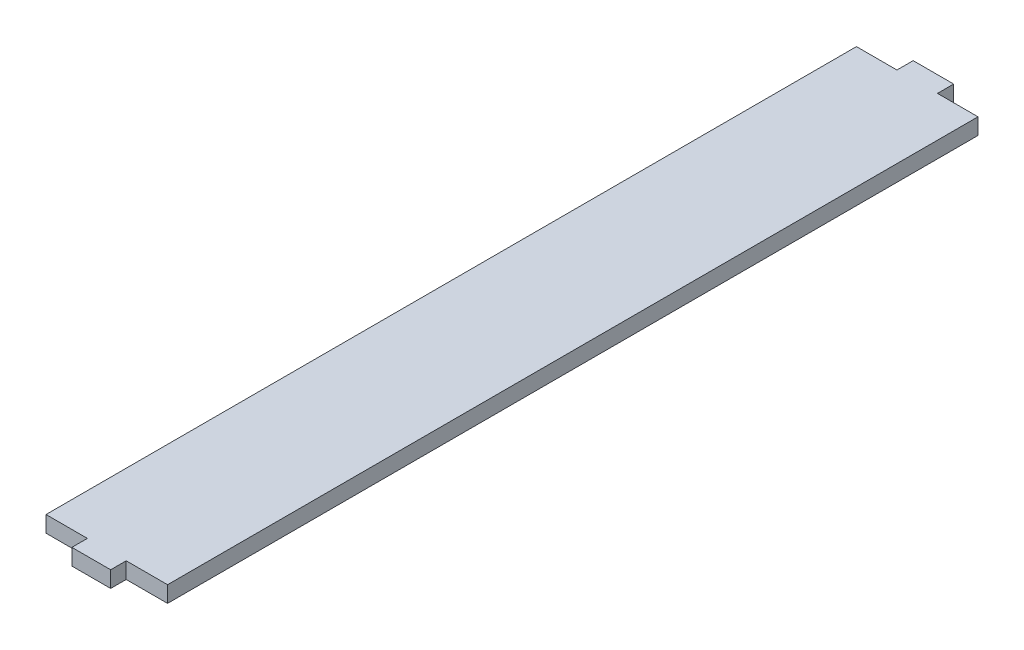
ISO-10303-21;
HEADER;
FILE_DESCRIPTION(('STEP AP214'),'2;1');
FILE_NAME('part.step','',(''),(''),'','','');
FILE_SCHEMA(('AUTOMOTIVE_DESIGN { 1 0 10303 214 1 1 1 1 }'));
ENDSEC;
DATA;
#1=APPLICATION_CONTEXT('core data for automotive mechanical design processes');
#2=APPLICATION_PROTOCOL_DEFINITION('international standard','automotive_design',2000,#1);
#3=PRODUCT_CONTEXT('',#1,'mechanical');
#4=PRODUCT('Part','Part','',(#3));
#5=PRODUCT_RELATED_PRODUCT_CATEGORY('part','',(#4));
#6=PRODUCT_DEFINITION_FORMATION('','',#4);
#7=PRODUCT_DEFINITION_CONTEXT('part definition',#1,'design');
#8=PRODUCT_DEFINITION('design','',#6,#7);
#9=PRODUCT_DEFINITION_SHAPE('','',#8);
#10=(LENGTH_UNIT() NAMED_UNIT(*) SI_UNIT(.MILLI.,.METRE.));
#11=(NAMED_UNIT(*) PLANE_ANGLE_UNIT() SI_UNIT($,.RADIAN.));
#12=(NAMED_UNIT(*) SI_UNIT($,.STERADIAN.) SOLID_ANGLE_UNIT());
#13=UNCERTAINTY_MEASURE_WITH_UNIT(LENGTH_MEASURE(1.E-05),#10,'distance_accuracy_value','');
#14=(GEOMETRIC_REPRESENTATION_CONTEXT(3) GLOBAL_UNCERTAINTY_ASSIGNED_CONTEXT((#13)) GLOBAL_UNIT_ASSIGNED_CONTEXT((#10,
#11,#12)) REPRESENTATION_CONTEXT('',''));
#15=CARTESIAN_POINT('',(0.,0.,0.));
#16=DIRECTION('',(0.,0.,1.));
#17=DIRECTION('',(1.,0.,0.));
#18=AXIS2_PLACEMENT_3D('',#15,#16,#17);
#19=CARTESIAN_POINT('',(-83.6227476409464,4.,31.5625003395719));
#20=DIRECTION('',(0.,0.,-1.));
#21=DIRECTION('',(-1.,0.,0.));
#22=AXIS2_PLACEMENT_3D('',#19,#20,#21);
#23=PLANE('',#22);
#24=DIRECTION('',(1.,0.,0.));
#25=VECTOR('',#24,1.);
#26=CARTESIAN_POINT('',(-83.6227476409464,0.,31.5625003395719));
#27=LINE('',#26,#25);
#28=CARTESIAN_POINT('',(84.6360776419923,0.,31.5625003395718));
#29=VERTEX_POINT('',#28);
#30=CARTESIAN_POINT('',(94.8481880682739,0.,31.5625003395718));
#31=VERTEX_POINT('',#30);
#32=EDGE_CURVE('E238',#29,#31,#27,.T.);
#33=ORIENTED_EDGE('',*,*,#32,.T.);
#34=DIRECTION('',(0.,-1.,0.));
#35=VECTOR('',#34,1.);
#36=CARTESIAN_POINT('',(94.8481880682739,4.,31.5625003395718));
#37=LINE('',#36,#35);
#38=CARTESIAN_POINT('',(94.8481880682739,4.,31.5625003395718));
#39=VERTEX_POINT('',#38);
#40=EDGE_CURVE('E136',#39,#31,#37,.T.);
#41=ORIENTED_EDGE('',*,*,#40,.F.);
#42=DIRECTION('',(1.,0.,0.));
#43=VECTOR('',#42,1.);
#44=CARTESIAN_POINT('',(-83.6227476409464,4.,31.5625003395719));
#45=LINE('',#44,#43);
#46=CARTESIAN_POINT('',(84.6360776419923,4.,31.5625003395718));
#47=VERTEX_POINT('',#46);
#48=EDGE_CURVE('E285',#47,#39,#45,.T.);
#49=ORIENTED_EDGE('',*,*,#48,.F.);
#50=DIRECTION('',(0.,-1.,0.));
#51=VECTOR('',#50,1.);
#52=CARTESIAN_POINT('',(84.6360776419923,4.,31.5625003395718));
#53=LINE('',#52,#51);
#54=EDGE_CURVE('E12',#47,#29,#53,.T.);
#55=ORIENTED_EDGE('',*,*,#54,.T.);
#56=EDGE_LOOP('',(#33,#41,#49,#55));
#57=FACE_BOUND('',#56,.T.);
#58=ADVANCED_FACE('F126',(#57),#23,.F.);
#59=CARTESIAN_POINT('',(94.8481880682738,4.,-68.5223438309408));
#60=DIRECTION('',(1.,0.,0.));
#61=DIRECTION('',(0.,0.,-1.));
#62=AXIS2_PLACEMENT_3D('',#59,#60,#61);
#63=PLANE('',#62);
#64=DIRECTION('',(0.,0.,1.));
#65=VECTOR('',#64,1.);
#66=CARTESIAN_POINT('',(94.8481880682738,0.,-68.5223438309408));
#67=LINE('',#66,#65);
#68=CARTESIAN_POINT('',(94.8481880682738,0.,-168.437499660428));
#69=VERTEX_POINT('',#68);
#70=EDGE_CURVE('E271',#69,#31,#67,.T.);
#71=ORIENTED_EDGE('',*,*,#70,.F.);
#72=DIRECTION('',(0.,-1.,0.));
#73=VECTOR('',#72,1.);
#74=CARTESIAN_POINT('',(94.8481880682738,4.,-168.437499660428));
#75=LINE('',#74,#73);
#76=CARTESIAN_POINT('',(94.8481880682738,4.,-168.437499660428));
#77=VERTEX_POINT('',#76);
#78=EDGE_CURVE('E253',#77,#69,#75,.T.);
#79=ORIENTED_EDGE('',*,*,#78,.F.);
#80=DIRECTION('',(0.,0.,1.));
#81=VECTOR('',#80,1.);
#82=CARTESIAN_POINT('',(94.8481880682738,4.,-68.5223438309408));
#83=LINE('',#82,#81);
#84=EDGE_CURVE('E282',#77,#39,#83,.T.);
#85=ORIENTED_EDGE('',*,*,#84,.T.);
#86=ORIENTED_EDGE('',*,*,#40,.T.);
#87=EDGE_LOOP('',(#71,#79,#85,#86));
#88=FACE_BOUND('',#87,.T.);
#89=ADVANCED_FACE('F324',(#88),#63,.T.);
#90=CARTESIAN_POINT('',(-83.6227476409465,4.,-168.437499660428));
#91=DIRECTION('',(0.,0.,-1.));
#92=DIRECTION('',(-1.,0.,0.));
#93=AXIS2_PLACEMENT_3D('',#90,#91,#92);
#94=PLANE('',#93);
#95=DIRECTION('',(1.,0.,0.));
#96=VECTOR('',#95,1.);
#97=CARTESIAN_POINT('',(-83.6227476409465,0.,-168.437499660428));
#98=LINE('',#97,#96);
#99=CARTESIAN_POINT('',(84.8481880682738,0.,-168.437499660428));
#100=VERTEX_POINT('',#99);
#101=EDGE_CURVE('E269',#100,#69,#98,.T.);
#102=ORIENTED_EDGE('',*,*,#101,.F.);
#103=DIRECTION('',(0.,-1.,0.));
#104=VECTOR('',#103,1.);
#105=CARTESIAN_POINT('',(84.8481880682738,4.,-168.437499660428));
#106=LINE('',#105,#104);
#107=CARTESIAN_POINT('',(84.8481880682738,4.,-168.437499660428));
#108=VERTEX_POINT('',#107);
#109=EDGE_CURVE('E211',#108,#100,#106,.T.);
#110=ORIENTED_EDGE('',*,*,#109,.F.);
#111=DIRECTION('',(1.,0.,0.));
#112=VECTOR('',#111,1.);
#113=CARTESIAN_POINT('',(-83.6227476409465,4.,-168.437499660428));
#114=LINE('',#113,#112);
#115=EDGE_CURVE('E279',#108,#77,#114,.T.);
#116=ORIENTED_EDGE('',*,*,#115,.T.);
#117=ORIENTED_EDGE('',*,*,#78,.T.);
#118=EDGE_LOOP('',(#102,#110,#116,#117));
#119=FACE_BOUND('',#118,.T.);
#120=ADVANCED_FACE('F328',(#119),#94,.T.);
#121=CARTESIAN_POINT('',(64.8481880682738,0.,-168.437499660428));
#122=VERTEX_POINT('',#121);
#123=CARTESIAN_POINT('',(74.8481880682739,0.,-168.437499660428));
#124=VERTEX_POINT('',#123);
#125=EDGE_CURVE('E268',#122,#124,#98,.T.);
#126=ORIENTED_EDGE('',*,*,#125,.F.);
#127=DIRECTION('',(0.,-1.,0.));
#128=VECTOR('',#127,1.);
#129=CARTESIAN_POINT('',(64.8481880682738,4.,-168.437499660428));
#130=LINE('',#129,#128);
#131=CARTESIAN_POINT('',(64.8481880682738,4.,-168.437499660428));
#132=VERTEX_POINT('',#131);
#133=EDGE_CURVE('E258',#132,#122,#130,.T.);
#134=ORIENTED_EDGE('',*,*,#133,.F.);
#135=CARTESIAN_POINT('',(74.8481880682739,4.,-168.437499660428));
#136=VERTEX_POINT('',#135);
#137=EDGE_CURVE('E278',#132,#136,#114,.T.);
#138=ORIENTED_EDGE('',*,*,#137,.T.);
#139=DIRECTION('',(0.,-1.,0.));
#140=VECTOR('',#139,1.);
#141=CARTESIAN_POINT('',(74.8481880682739,4.,-168.437499660428));
#142=LINE('',#141,#140);
#143=EDGE_CURVE('E256',#136,#124,#142,.T.);
#144=ORIENTED_EDGE('',*,*,#143,.T.);
#145=EDGE_LOOP('',(#126,#134,#138,#144));
#146=FACE_BOUND('',#145,.T.);
#147=ADVANCED_FACE('F338',(#146),#94,.T.);
#148=CARTESIAN_POINT('',(64.8481880682739,4.,-68.5223438309408));
#149=DIRECTION('',(1.,0.,0.));
#150=DIRECTION('',(0.,0.,-1.));
#151=AXIS2_PLACEMENT_3D('',#148,#149,#150);
#152=PLANE('',#151);
#153=DIRECTION('',(0.,0.,1.));
#154=VECTOR('',#153,1.);
#155=CARTESIAN_POINT('',(64.8481880682739,0.,-68.5223438309408));
#156=LINE('',#155,#154);
#157=CARTESIAN_POINT('',(64.8481880682739,0.,31.5625003395718));
#158=VERTEX_POINT('',#157);
#159=EDGE_CURVE('E265',#122,#158,#156,.T.);
#160=ORIENTED_EDGE('',*,*,#159,.T.);
#161=DIRECTION('',(0.,-1.,0.));
#162=VECTOR('',#161,1.);
#163=CARTESIAN_POINT('',(64.8481880682739,4.,31.5625003395718));
#164=LINE('',#163,#162);
#165=CARTESIAN_POINT('',(64.8481880682739,4.,31.5625003395718));
#166=VERTEX_POINT('',#165);
#167=EDGE_CURVE('E260',#166,#158,#164,.T.);
#168=ORIENTED_EDGE('',*,*,#167,.F.);
#169=DIRECTION('',(0.,0.,1.));
#170=VECTOR('',#169,1.);
#171=CARTESIAN_POINT('',(64.8481880682739,4.,-68.5223438309408));
#172=LINE('',#171,#170);
#173=EDGE_CURVE('E276',#132,#166,#172,.T.);
#174=ORIENTED_EDGE('',*,*,#173,.F.);
#175=ORIENTED_EDGE('',*,*,#133,.T.);
#176=EDGE_LOOP('',(#160,#168,#174,#175));
#177=FACE_BOUND('',#176,.T.);
#178=ADVANCED_FACE('F339',(#177),#152,.F.);
#179=CARTESIAN_POINT('',(75.0602984945554,0.,31.5625003395718));
#180=VERTEX_POINT('',#179);
#181=EDGE_CURVE('E267',#158,#180,#27,.T.);
#182=ORIENTED_EDGE('',*,*,#181,.T.);
#183=DIRECTION('',(0.,-1.,0.));
#184=VECTOR('',#183,1.);
#185=CARTESIAN_POINT('',(75.0602984945554,4.,31.5625003395718));
#186=LINE('',#185,#184);
#187=CARTESIAN_POINT('',(75.0602984945554,4.,31.5625003395718));
#188=VERTEX_POINT('',#187);
#189=EDGE_CURVE('E145',#188,#180,#186,.T.);
#190=ORIENTED_EDGE('',*,*,#189,.F.);
#191=EDGE_CURVE('E264',#166,#188,#45,.T.);
#192=ORIENTED_EDGE('',*,*,#191,.F.);
#193=ORIENTED_EDGE('',*,*,#167,.T.);
#194=EDGE_LOOP('',(#182,#190,#192,#193));
#195=FACE_BOUND('',#194,.T.);
#196=ADVANCED_FACE('F299',(#195),#23,.F.);
#197=CARTESIAN_POINT('',(-83.6227476409465,0.,-68.5223438309408));
#198=DIRECTION('',(0.,1.,0.));
#199=DIRECTION('',(0.,0.,1.));
#200=AXIS2_PLACEMENT_3D('',#197,#198,#199);
#201=PLANE('',#200);
#202=DIRECTION('',(0.,0.,-1.));
#203=VECTOR('',#202,1.);
#204=CARTESIAN_POINT('',(84.8481880682738,0.,-164.437499660428));
#205=LINE('',#204,#203);
#206=CARTESIAN_POINT('',(84.8481880682738,0.,-172.437499660428));
#207=VERTEX_POINT('',#206);
#208=EDGE_CURVE('E204',#100,#207,#205,.T.);
#209=ORIENTED_EDGE('',*,*,#208,.F.);
#210=ORIENTED_EDGE('',*,*,#101,.T.);
#211=ORIENTED_EDGE('',*,*,#70,.T.);
#212=ORIENTED_EDGE('',*,*,#32,.F.);
#213=DIRECTION('',(0.,0.,-1.));
#214=VECTOR('',#213,1.);
#215=CARTESIAN_POINT('',(84.6360776419923,0.,35.3928119985466));
#216=LINE('',#215,#214);
#217=CARTESIAN_POINT('',(84.6360776419923,0.,35.3928119985466));
#218=VERTEX_POINT('',#217);
#219=EDGE_CURVE('E242',#218,#29,#216,.T.);
#220=ORIENTED_EDGE('',*,*,#219,.F.);
#221=DIRECTION('',(1.,0.,0.));
#222=VECTOR('',#221,1.);
#223=CARTESIAN_POINT('',(75.0602984945554,0.,35.3928119985466));
#224=LINE('',#223,#222);
#225=CARTESIAN_POINT('',(75.0602984945554,0.,35.3928119985466));
#226=VERTEX_POINT('',#225);
#227=EDGE_CURVE('E239',#226,#218,#224,.T.);
#228=ORIENTED_EDGE('',*,*,#227,.F.);
#229=DIRECTION('',(0.,0.,-1.));
#230=VECTOR('',#229,1.);
#231=CARTESIAN_POINT('',(75.0602984945554,0.,35.3928119985466));
#232=LINE('',#231,#230);
#233=EDGE_CURVE('E223',#226,#180,#232,.T.);
#234=ORIENTED_EDGE('',*,*,#233,.T.);
#235=ORIENTED_EDGE('',*,*,#181,.F.);
#236=ORIENTED_EDGE('',*,*,#159,.F.);
#237=ORIENTED_EDGE('',*,*,#125,.T.);
#238=DIRECTION('',(0.,0.,-1.));
#239=VECTOR('',#238,1.);
#240=CARTESIAN_POINT('',(74.8481880682738,0.,-164.437499660428));
#241=LINE('',#240,#239);
#242=CARTESIAN_POINT('',(74.8481880682738,0.,-172.437499660428));
#243=VERTEX_POINT('',#242);
#244=EDGE_CURVE('E198',#124,#243,#241,.T.);
#245=ORIENTED_EDGE('',*,*,#244,.T.);
#246=DIRECTION('',(1.,0.,0.));
#247=VECTOR('',#246,1.);
#248=CARTESIAN_POINT('',(74.8481880682738,0.,-172.437499660428));
#249=LINE('',#248,#247);
#250=EDGE_CURVE('E215',#243,#207,#249,.T.);
#251=ORIENTED_EDGE('',*,*,#250,.T.);
#252=EDGE_LOOP('',(#209,#210,#211,#212,#220,#228,#234,#235,#236,#237,#245,#251));
#253=FACE_BOUND('',#252,.T.);
#254=ADVANCED_FACE('F224',(#253),#201,.F.);
#255=CARTESIAN_POINT('',(-83.6227476409465,4.,-68.5223438309408));
#256=DIRECTION('',(0.,1.,0.));
#257=DIRECTION('',(0.,0.,1.));
#258=AXIS2_PLACEMENT_3D('',#255,#256,#257);
#259=PLANE('',#258);
#260=ORIENTED_EDGE('',*,*,#115,.F.);
#261=DIRECTION('',(0.,0.,-1.));
#262=VECTOR('',#261,1.);
#263=CARTESIAN_POINT('',(84.8481880682738,4.,-164.437499660428));
#264=LINE('',#263,#262);
#265=CARTESIAN_POINT('',(84.8481880682738,4.,-172.437499660428));
#266=VERTEX_POINT('',#265);
#267=EDGE_CURVE('E228',#108,#266,#264,.T.);
#268=ORIENTED_EDGE('',*,*,#267,.T.);
#269=DIRECTION('',(1.,0.,0.));
#270=VECTOR('',#269,1.);
#271=CARTESIAN_POINT('',(74.8481880682738,4.,-172.437499660428));
#272=LINE('',#271,#270);
#273=CARTESIAN_POINT('',(74.8481880682738,4.,-172.437499660428));
#274=VERTEX_POINT('',#273);
#275=EDGE_CURVE('E222',#274,#266,#272,.T.);
#276=ORIENTED_EDGE('',*,*,#275,.F.);
#277=DIRECTION('',(0.,0.,-1.));
#278=VECTOR('',#277,1.);
#279=CARTESIAN_POINT('',(74.8481880682738,4.,-164.437499660428));
#280=LINE('',#279,#278);
#281=EDGE_CURVE('E214',#136,#274,#280,.T.);
#282=ORIENTED_EDGE('',*,*,#281,.F.);
#283=ORIENTED_EDGE('',*,*,#137,.F.);
#284=ORIENTED_EDGE('',*,*,#173,.T.);
#285=ORIENTED_EDGE('',*,*,#191,.T.);
#286=DIRECTION('',(0.,0.,-1.));
#287=VECTOR('',#286,1.);
#288=CARTESIAN_POINT('',(75.0602984945554,4.,35.3928119985466));
#289=LINE('',#288,#287);
#290=CARTESIAN_POINT('',(75.0602984945554,4.,35.3928119985466));
#291=VERTEX_POINT('',#290);
#292=EDGE_CURVE('E241',#291,#188,#289,.T.);
#293=ORIENTED_EDGE('',*,*,#292,.F.);
#294=DIRECTION('',(1.,0.,0.));
#295=VECTOR('',#294,1.);
#296=CARTESIAN_POINT('',(75.0602984945554,4.,35.3928119985466));
#297=LINE('',#296,#295);
#298=CARTESIAN_POINT('',(84.6360776419923,4.,35.3928119985466));
#299=VERTEX_POINT('',#298);
#300=EDGE_CURVE('E236',#291,#299,#297,.T.);
#301=ORIENTED_EDGE('',*,*,#300,.T.);
#302=DIRECTION('',(0.,0.,-1.));
#303=VECTOR('',#302,1.);
#304=CARTESIAN_POINT('',(84.6360776419923,4.,35.3928119985466));
#305=LINE('',#304,#303);
#306=EDGE_CURVE('E248',#299,#47,#305,.T.);
#307=ORIENTED_EDGE('',*,*,#306,.T.);
#308=ORIENTED_EDGE('',*,*,#48,.T.);
#309=ORIENTED_EDGE('',*,*,#84,.F.);
#310=EDGE_LOOP('',(#260,#268,#276,#282,#283,#284,#285,#293,#301,#307,#308,#309));
#311=FACE_BOUND('',#310,.T.);
#312=ADVANCED_FACE('F295',(#311),#259,.T.);
#313=CARTESIAN_POINT('',(84.8481880682738,4.,-164.437499660428));
#314=DIRECTION('',(-1.,0.,0.));
#315=DIRECTION('',(0.,0.,1.));
#316=AXIS2_PLACEMENT_3D('',#313,#314,#315);
#317=PLANE('',#316);
#318=ORIENTED_EDGE('',*,*,#267,.F.);
#319=ORIENTED_EDGE('',*,*,#109,.T.);
#320=ORIENTED_EDGE('',*,*,#208,.T.);
#321=DIRECTION('',(0.,-1.,0.));
#322=VECTOR('',#321,1.);
#323=CARTESIAN_POINT('',(84.8481880682738,4.,-172.437499660428));
#324=LINE('',#323,#322);
#325=EDGE_CURVE('E208',#266,#207,#324,.T.);
#326=ORIENTED_EDGE('',*,*,#325,.F.);
#327=EDGE_LOOP('',(#318,#319,#320,#326));
#328=FACE_BOUND('',#327,.T.);
#329=ADVANCED_FACE('F207',(#328),#317,.F.);
#330=CARTESIAN_POINT('',(74.8481880682738,4.,-172.437499660428));
#331=DIRECTION('',(0.,0.,-1.));
#332=DIRECTION('',(-1.,0.,0.));
#333=AXIS2_PLACEMENT_3D('',#330,#331,#332);
#334=PLANE('',#333);
#335=ORIENTED_EDGE('',*,*,#250,.F.);
#336=DIRECTION('',(0.,-1.,0.));
#337=VECTOR('',#336,1.);
#338=CARTESIAN_POINT('',(74.8481880682738,4.,-172.437499660428));
#339=LINE('',#338,#337);
#340=EDGE_CURVE('E130',#274,#243,#339,.T.);
#341=ORIENTED_EDGE('',*,*,#340,.F.);
#342=ORIENTED_EDGE('',*,*,#275,.T.);
#343=ORIENTED_EDGE('',*,*,#325,.T.);
#344=EDGE_LOOP('',(#335,#341,#342,#343));
#345=FACE_BOUND('',#344,.T.);
#346=ADVANCED_FACE('F219',(#345),#334,.T.);
#347=CARTESIAN_POINT('',(74.8481880682738,4.,-164.437499660428));
#348=DIRECTION('',(-1.,0.,0.));
#349=DIRECTION('',(0.,0.,1.));
#350=AXIS2_PLACEMENT_3D('',#347,#348,#349);
#351=PLANE('',#350);
#352=ORIENTED_EDGE('',*,*,#244,.F.);
#353=ORIENTED_EDGE('',*,*,#143,.F.);
#354=ORIENTED_EDGE('',*,*,#281,.T.);
#355=ORIENTED_EDGE('',*,*,#340,.T.);
#356=EDGE_LOOP('',(#352,#353,#354,#355));
#357=FACE_BOUND('',#356,.T.);
#358=ADVANCED_FACE('F128',(#357),#351,.T.);
#359=CARTESIAN_POINT('',(75.0602984945554,4.,35.3928119985466));
#360=DIRECTION('',(0.,0.,-1.));
#361=DIRECTION('',(-1.,0.,0.));
#362=AXIS2_PLACEMENT_3D('',#359,#360,#361);
#363=PLANE('',#362);
#364=ORIENTED_EDGE('',*,*,#227,.T.);
#365=DIRECTION('',(0.,-1.,0.));
#366=VECTOR('',#365,1.);
#367=CARTESIAN_POINT('',(84.6360776419923,4.,35.3928119985466));
#368=LINE('',#367,#366);
#369=EDGE_CURVE('E232',#299,#218,#368,.T.);
#370=ORIENTED_EDGE('',*,*,#369,.F.);
#371=ORIENTED_EDGE('',*,*,#300,.F.);
#372=DIRECTION('',(0.,-1.,0.));
#373=VECTOR('',#372,1.);
#374=CARTESIAN_POINT('',(75.0602984945554,4.,35.3928119985466));
#375=LINE('',#374,#373);
#376=EDGE_CURVE('E235',#291,#226,#375,.T.);
#377=ORIENTED_EDGE('',*,*,#376,.T.);
#378=EDGE_LOOP('',(#364,#370,#371,#377));
#379=FACE_BOUND('',#378,.T.);
#380=ADVANCED_FACE('F312',(#379),#363,.F.);
#381=CARTESIAN_POINT('',(84.6360776419923,4.,35.3928119985466));
#382=DIRECTION('',(-1.,0.,0.));
#383=DIRECTION('',(0.,0.,1.));
#384=AXIS2_PLACEMENT_3D('',#381,#382,#383);
#385=PLANE('',#384);
#386=ORIENTED_EDGE('',*,*,#219,.T.);
#387=ORIENTED_EDGE('',*,*,#54,.F.);
#388=ORIENTED_EDGE('',*,*,#306,.F.);
#389=ORIENTED_EDGE('',*,*,#369,.T.);
#390=EDGE_LOOP('',(#386,#387,#388,#389));
#391=FACE_BOUND('',#390,.T.);
#392=ADVANCED_FACE('F364',(#391),#385,.F.);
#393=CARTESIAN_POINT('',(75.0602984945554,4.,35.3928119985466));
#394=DIRECTION('',(-1.,0.,0.));
#395=DIRECTION('',(0.,0.,1.));
#396=AXIS2_PLACEMENT_3D('',#393,#394,#395);
#397=PLANE('',#396);
#398=ORIENTED_EDGE('',*,*,#292,.T.);
#399=ORIENTED_EDGE('',*,*,#189,.T.);
#400=ORIENTED_EDGE('',*,*,#233,.F.);
#401=ORIENTED_EDGE('',*,*,#376,.F.);
#402=EDGE_LOOP('',(#398,#399,#400,#401));
#403=FACE_BOUND('',#402,.T.);
#404=ADVANCED_FACE('F308',(#403),#397,.T.);
#405=CLOSED_SHELL('',(#58,#89,#120,#147,#178,#196,#254,#312,#329,#346,#358,#380,#392,#404));
#406=MANIFOLD_SOLID_BREP('B2',#405);
#407=ADVANCED_BREP_SHAPE_REPRESENTATION('',(#18,#406),#14);
#408=SHAPE_DEFINITION_REPRESENTATION(#9,#407);
ENDSEC;
END-ISO-10303-21;
